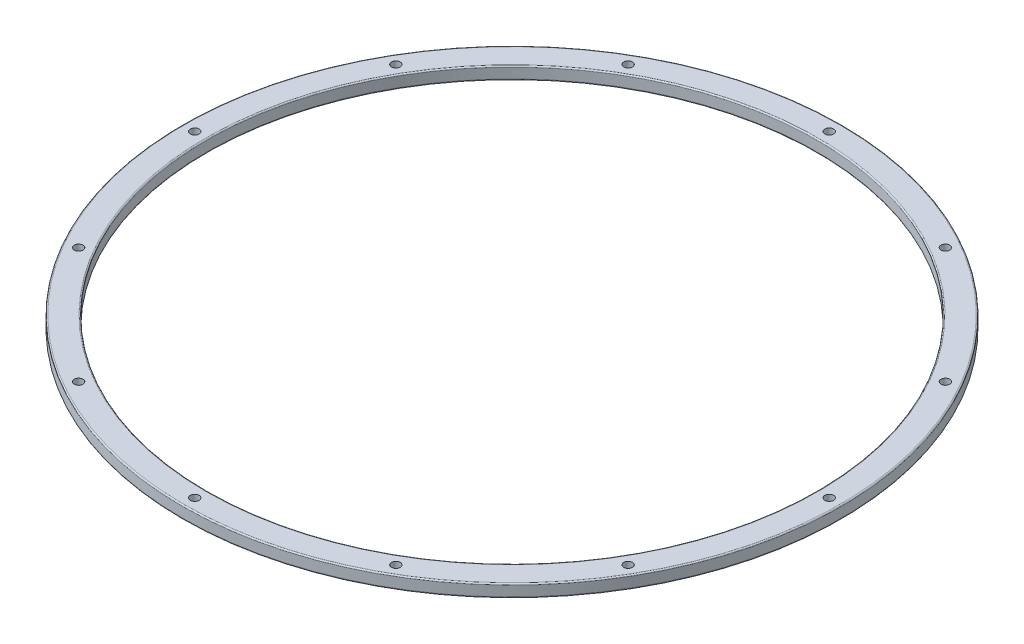
ISO-10303-21;
HEADER;
FILE_DESCRIPTION(('STEP AP214'),'2;1');
FILE_NAME('part.step','',(''),(''),'','','');
FILE_SCHEMA(('AUTOMOTIVE_DESIGN { 1 0 10303 214 1 1 1 1 }'));
ENDSEC;
DATA;
#1=APPLICATION_CONTEXT('core data for automotive mechanical design processes');
#2=APPLICATION_PROTOCOL_DEFINITION('international standard','automotive_design',2000,#1);
#3=PRODUCT_CONTEXT('',#1,'mechanical');
#4=PRODUCT('Part','Part','',(#3));
#5=PRODUCT_RELATED_PRODUCT_CATEGORY('part','',(#4));
#6=PRODUCT_DEFINITION_FORMATION('','',#4);
#7=PRODUCT_DEFINITION_CONTEXT('part definition',#1,'design');
#8=PRODUCT_DEFINITION('design','',#6,#7);
#9=PRODUCT_DEFINITION_SHAPE('','',#8);
#10=(LENGTH_UNIT() NAMED_UNIT(*) SI_UNIT(.MILLI.,.METRE.));
#11=(NAMED_UNIT(*) PLANE_ANGLE_UNIT() SI_UNIT($,.RADIAN.));
#12=(NAMED_UNIT(*) SI_UNIT($,.STERADIAN.) SOLID_ANGLE_UNIT());
#13=UNCERTAINTY_MEASURE_WITH_UNIT(LENGTH_MEASURE(1.E-05),#10,'distance_accuracy_value','');
#14=(GEOMETRIC_REPRESENTATION_CONTEXT(3) GLOBAL_UNCERTAINTY_ASSIGNED_CONTEXT((#13)) GLOBAL_UNIT_ASSIGNED_CONTEXT((#10,
#11,#12)) REPRESENTATION_CONTEXT('',''));
#15=CARTESIAN_POINT('',(0.,0.,0.));
#16=DIRECTION('',(0.,0.,1.));
#17=DIRECTION('',(1.,0.,0.));
#18=AXIS2_PLACEMENT_3D('',#15,#16,#17);
#19=CARTESIAN_POINT('',(-76.5175,3.17499999999999,0.));
#20=DIRECTION('',(0.,1.,0.));
#21=DIRECTION('',(0.,0.,1.));
#22=AXIS2_PLACEMENT_3D('',#19,#20,#21);
#23=PLANE('',#22);
#24=CARTESIAN_POINT('',(-68.6582775056797,3.175,39.6398749999993));
#25=DIRECTION('',(0.,-1.,0.));
#26=DIRECTION('',(0.,0.,-1.));
#27=AXIS2_PLACEMENT_3D('',#24,#25,#26);
#28=CIRCLE('',#27,1.0922);
#29=CARTESIAN_POINT('',(-68.6582775056797,3.175,38.5476749999993));
#30=VERTEX_POINT('',#29);
#31=EDGE_CURVE('E131',#30,#30,#28,.T.);
#32=ORIENTED_EDGE('',*,*,#31,.T.);
#33=EDGE_LOOP('',(#32));
#34=FACE_BOUND('',#33,.T.);
#35=CARTESIAN_POINT('',(-39.6398750000007,3.175,68.658277505679));
#36=DIRECTION('',(0.,-1.,0.));
#37=DIRECTION('',(0.,0.,-1.));
#38=AXIS2_PLACEMENT_3D('',#35,#36,#37);
#39=CIRCLE('',#38,1.0922);
#40=CARTESIAN_POINT('',(-39.6398750000007,3.175,67.5660775056789));
#41=VERTEX_POINT('',#40);
#42=EDGE_CURVE('E125',#41,#41,#39,.T.);
#43=ORIENTED_EDGE('',*,*,#42,.T.);
#44=EDGE_LOOP('',(#43));
#45=FACE_BOUND('',#44,.T.);
#46=CARTESIAN_POINT('',(79.27975,3.175,4.47985690742466E-13));
#47=DIRECTION('',(0.,-1.,0.));
#48=DIRECTION('',(0.,0.,-1.));
#49=AXIS2_PLACEMENT_3D('',#46,#47,#48);
#50=CIRCLE('',#49,1.0922);
#51=CARTESIAN_POINT('',(79.27975,3.175,-1.09219999999955));
#52=VERTEX_POINT('',#51);
#53=EDGE_CURVE('E101',#52,#52,#50,.T.);
#54=ORIENTED_EDGE('',*,*,#53,.T.);
#55=EDGE_LOOP('',(#54));
#56=FACE_BOUND('',#55,.T.);
#57=CARTESIAN_POINT('',(68.6582775056795,3.175,-39.6398749999996));
#58=DIRECTION('',(0.,-1.,0.));
#59=DIRECTION('',(0.,0.,-1.));
#60=AXIS2_PLACEMENT_3D('',#57,#58,#59);
#61=CIRCLE('',#60,1.0922);
#62=CARTESIAN_POINT('',(68.6582775056795,3.175,-40.7320749999997));
#63=VERTEX_POINT('',#62);
#64=EDGE_CURVE('E95',#63,#63,#61,.T.);
#65=ORIENTED_EDGE('',*,*,#64,.T.);
#66=EDGE_LOOP('',(#65));
#67=FACE_BOUND('',#66,.T.);
#68=CARTESIAN_POINT('',(39.6398750000002,3.175,-68.6582775056792));
#69=DIRECTION('',(0.,-1.,0.));
#70=DIRECTION('',(0.,0.,-1.));
#71=AXIS2_PLACEMENT_3D('',#68,#69,#70);
#72=CIRCLE('',#71,1.0922);
#73=CARTESIAN_POINT('',(39.6398750000002,3.175,-69.7504775056792));
#74=VERTEX_POINT('',#73);
#75=EDGE_CURVE('E89',#74,#74,#72,.T.);
#76=ORIENTED_EDGE('',*,*,#75,.T.);
#77=EDGE_LOOP('',(#76));
#78=FACE_BOUND('',#77,.T.);
#79=CARTESIAN_POINT('',(2.23992845371233E-13,3.175,-79.27975));
#80=DIRECTION('',(0.,-1.,0.));
#81=DIRECTION('',(0.,0.,-1.));
#82=AXIS2_PLACEMENT_3D('',#79,#80,#81);
#83=CIRCLE('',#82,1.0922);
#84=CARTESIAN_POINT('',(2.23992845371233E-13,3.175,-80.37195));
#85=VERTEX_POINT('',#84);
#86=EDGE_CURVE('E83',#85,#85,#83,.T.);
#87=ORIENTED_EDGE('',*,*,#86,.T.);
#88=EDGE_LOOP('',(#87));
#89=FACE_BOUND('',#88,.T.);
#90=CARTESIAN_POINT('',(-39.6398749999999,3.175,-68.6582775056794));
#91=DIRECTION('',(0.,-1.,0.));
#92=DIRECTION('',(0.,0.,-1.));
#93=AXIS2_PLACEMENT_3D('',#90,#91,#92);
#94=CIRCLE('',#93,1.0922);
#95=CARTESIAN_POINT('',(-39.6398749999999,3.175,-69.7504775056794));
#96=VERTEX_POINT('',#95);
#97=EDGE_CURVE('E77',#96,#96,#94,.T.);
#98=ORIENTED_EDGE('',*,*,#97,.T.);
#99=EDGE_LOOP('',(#98));
#100=FACE_BOUND('',#99,.T.);
#101=CARTESIAN_POINT('',(-68.6582775056793,3.175,-39.6398750000001));
#102=DIRECTION('',(0.,-1.,0.));
#103=DIRECTION('',(0.,0.,-1.));
#104=AXIS2_PLACEMENT_3D('',#101,#102,#103);
#105=CIRCLE('',#104,1.0922);
#106=CARTESIAN_POINT('',(-68.6582775056793,3.175,-40.7320750000001));
#107=VERTEX_POINT('',#106);
#108=EDGE_CURVE('E71',#107,#107,#105,.T.);
#109=ORIENTED_EDGE('',*,*,#108,.T.);
#110=EDGE_LOOP('',(#109));
#111=FACE_BOUND('',#110,.T.);
#112=CARTESIAN_POINT('',(-79.27975,3.175,0.));
#113=DIRECTION('',(0.,-1.,0.));
#114=DIRECTION('',(0.,0.,-1.));
#115=AXIS2_PLACEMENT_3D('',#112,#113,#114);
#116=CIRCLE('',#115,1.0922);
#117=CARTESIAN_POINT('',(-79.27975,3.175,-1.0922));
#118=VERTEX_POINT('',#117);
#119=EDGE_CURVE('E65',#118,#118,#116,.T.);
#120=ORIENTED_EDGE('',*,*,#119,.T.);
#121=EDGE_LOOP('',(#120));
#122=FACE_BOUND('',#121,.T.);
#123=CARTESIAN_POINT('',(0.,3.17499999999999,0.));
#124=DIRECTION('',(0.,1.,0.));
#125=DIRECTION('',(0.,0.,1.));
#126=AXIS2_PLACEMENT_3D('',#123,#124,#125);
#127=CIRCLE('',#126,82.042);
#128=CARTESIAN_POINT('',(0.,3.17499999999999,82.042));
#129=VERTEX_POINT('',#128);
#130=EDGE_CURVE('E62',#129,#129,#127,.T.);
#131=ORIENTED_EDGE('',*,*,#130,.T.);
#132=EDGE_LOOP('',(#131));
#133=FACE_BOUND('',#132,.T.);
#134=CARTESIAN_POINT('',(0.,3.175,0.));
#135=DIRECTION('',(0.,1.,0.));
#136=DIRECTION('',(0.,0.,1.));
#137=AXIS2_PLACEMENT_3D('',#134,#135,#136);
#138=CIRCLE('',#137,76.5175);
#139=CARTESIAN_POINT('',(0.,3.175,76.5175));
#140=VERTEX_POINT('',#139);
#141=EDGE_CURVE('E59',#140,#140,#138,.T.);
#142=ORIENTED_EDGE('',*,*,#141,.F.);
#143=EDGE_LOOP('',(#142));
#144=FACE_BOUND('',#143,.T.);
#145=CARTESIAN_POINT('',(68.6582775056791,3.175,39.6398750000004));
#146=DIRECTION('',(0.,-1.,0.));
#147=DIRECTION('',(0.,0.,-1.));
#148=AXIS2_PLACEMENT_3D('',#145,#146,#147);
#149=CIRCLE('',#148,1.0922);
#150=CARTESIAN_POINT('',(68.6582775056791,3.175,38.5476750000004));
#151=VERTEX_POINT('',#150);
#152=EDGE_CURVE('E107',#151,#151,#149,.T.);
#153=ORIENTED_EDGE('',*,*,#152,.T.);
#154=EDGE_LOOP('',(#153));
#155=FACE_BOUND('',#154,.T.);
#156=CARTESIAN_POINT('',(39.6398749999995,3.175,68.6582775056796));
#157=DIRECTION('',(0.,-1.,0.));
#158=DIRECTION('',(0.,0.,-1.));
#159=AXIS2_PLACEMENT_3D('',#156,#157,#158);
#160=CIRCLE('',#159,1.0922);
#161=CARTESIAN_POINT('',(39.6398749999995,3.175,67.5660775056796));
#162=VERTEX_POINT('',#161);
#163=EDGE_CURVE('E113',#162,#162,#160,.T.);
#164=ORIENTED_EDGE('',*,*,#163,.T.);
#165=EDGE_LOOP('',(#164));
#166=FACE_BOUND('',#165,.T.);
#167=CARTESIAN_POINT('',(-6.89582176881005E-13,3.175,79.27975));
#168=DIRECTION('',(0.,-1.,0.));
#169=DIRECTION('',(0.,0.,-1.));
#170=AXIS2_PLACEMENT_3D('',#167,#168,#169);
#171=CIRCLE('',#170,1.0922);
#172=CARTESIAN_POINT('',(-6.89582176881005E-13,3.175,78.18755));
#173=VERTEX_POINT('',#172);
#174=EDGE_CURVE('E119',#173,#173,#171,.T.);
#175=ORIENTED_EDGE('',*,*,#174,.T.);
#176=EDGE_LOOP('',(#175));
#177=FACE_BOUND('',#176,.T.);
#178=ADVANCED_FACE('F33',(#34,#45,#56,#67,#78,#89,#100,#111,#122,#133,#144,#155,#166,#177),#23,.T.);
#179=CARTESIAN_POINT('',(0.,2.85749999999999,0.));
#180=DIRECTION('',(0.,1.,0.));
#181=DIRECTION('',(0.,0.,1.));
#182=AXIS2_PLACEMENT_3D('',#179,#180,#181);
#183=TOROIDAL_SURFACE('',#182,82.042,0.317499999999999);
#184=CARTESIAN_POINT('',(0.,2.85749999999999,0.));
#185=DIRECTION('',(0.,1.,0.));
#186=DIRECTION('',(0.,0.,1.));
#187=AXIS2_PLACEMENT_3D('',#184,#185,#186);
#188=CIRCLE('',#187,82.3595);
#189=CARTESIAN_POINT('',(0.,2.85749999999999,82.3595));
#190=VERTEX_POINT('',#189);
#191=EDGE_CURVE('E10',#190,#190,#188,.T.);
#192=ORIENTED_EDGE('',*,*,#191,.T.);
#193=EDGE_LOOP('',(#192));
#194=FACE_BOUND('',#193,.T.);
#195=ORIENTED_EDGE('',*,*,#130,.F.);
#196=EDGE_LOOP('',(#195));
#197=FACE_BOUND('',#196,.T.);
#198=ADVANCED_FACE('F35',(#194,#197),#183,.T.);
#199=CARTESIAN_POINT('',(0.,55.,0.));
#200=DIRECTION('',(0.,1.,0.));
#201=DIRECTION('',(0.,0.,1.));
#202=AXIS2_PLACEMENT_3D('',#199,#200,#201);
#203=CYLINDRICAL_SURFACE('',#202,82.3595);
#204=CARTESIAN_POINT('',(0.,0.317499999999991,0.));
#205=DIRECTION('',(0.,1.,0.));
#206=DIRECTION('',(0.,0.,1.));
#207=AXIS2_PLACEMENT_3D('',#204,#205,#206);
#208=CIRCLE('',#207,82.3595);
#209=CARTESIAN_POINT('',(0.,0.317499999999991,82.3595));
#210=VERTEX_POINT('',#209);
#211=EDGE_CURVE('E40',#210,#210,#208,.T.);
#212=ORIENTED_EDGE('',*,*,#211,.T.);
#213=EDGE_LOOP('',(#212));
#214=FACE_BOUND('',#213,.T.);
#215=ORIENTED_EDGE('',*,*,#191,.F.);
#216=EDGE_LOOP('',(#215));
#217=FACE_BOUND('',#216,.T.);
#218=ADVANCED_FACE('F174',(#214,#217),#203,.T.);
#219=CARTESIAN_POINT('',(0.,0.317499999999993,0.));
#220=DIRECTION('',(0.,1.,0.));
#221=DIRECTION('',(0.,0.,1.));
#222=AXIS2_PLACEMENT_3D('',#219,#220,#221);
#223=TOROIDAL_SURFACE('',#222,82.042,0.317499999999999);
#224=CARTESIAN_POINT('',(0.,0.,0.));
#225=DIRECTION('',(0.,1.,0.));
#226=DIRECTION('',(0.,0.,1.));
#227=AXIS2_PLACEMENT_3D('',#224,#225,#226);
#228=CIRCLE('',#227,82.042);
#229=CARTESIAN_POINT('',(0.,0.,82.042));
#230=VERTEX_POINT('',#229);
#231=EDGE_CURVE('E44',#230,#230,#228,.T.);
#232=ORIENTED_EDGE('',*,*,#231,.T.);
#233=EDGE_LOOP('',(#232));
#234=FACE_BOUND('',#233,.T.);
#235=ORIENTED_EDGE('',*,*,#211,.F.);
#236=EDGE_LOOP('',(#235));
#237=FACE_BOUND('',#236,.T.);
#238=ADVANCED_FACE('F144',(#234,#237),#223,.T.);
#239=CARTESIAN_POINT('',(-76.5175,0.,0.));
#240=DIRECTION('',(0.,-1.,0.));
#241=DIRECTION('',(0.,0.,-1.));
#242=AXIS2_PLACEMENT_3D('',#239,#240,#241);
#243=PLANE('',#242);
#244=CARTESIAN_POINT('',(-68.6582775056797,0.,39.6398749999993));
#245=DIRECTION('',(0.,-1.,0.));
#246=DIRECTION('',(0.,0.,-1.));
#247=AXIS2_PLACEMENT_3D('',#244,#245,#246);
#248=CIRCLE('',#247,1.0922);
#249=CARTESIAN_POINT('',(-68.6582775056797,0.,38.5476749999993));
#250=VERTEX_POINT('',#249);
#251=EDGE_CURVE('E134',#250,#250,#248,.T.);
#252=ORIENTED_EDGE('',*,*,#251,.F.);
#253=EDGE_LOOP('',(#252));
#254=FACE_BOUND('',#253,.T.);
#255=CARTESIAN_POINT('',(-39.6398750000007,0.,68.658277505679));
#256=DIRECTION('',(0.,-1.,0.));
#257=DIRECTION('',(0.,0.,-1.));
#258=AXIS2_PLACEMENT_3D('',#255,#256,#257);
#259=CIRCLE('',#258,1.0922);
#260=CARTESIAN_POINT('',(-39.6398750000007,0.,67.5660775056789));
#261=VERTEX_POINT('',#260);
#262=EDGE_CURVE('E128',#261,#261,#259,.T.);
#263=ORIENTED_EDGE('',*,*,#262,.F.);
#264=EDGE_LOOP('',(#263));
#265=FACE_BOUND('',#264,.T.);
#266=CARTESIAN_POINT('',(-6.89582176881005E-13,0.,79.27975));
#267=DIRECTION('',(0.,-1.,0.));
#268=DIRECTION('',(0.,0.,-1.));
#269=AXIS2_PLACEMENT_3D('',#266,#267,#268);
#270=CIRCLE('',#269,1.0922);
#271=CARTESIAN_POINT('',(-6.89582176881005E-13,0.,78.18755));
#272=VERTEX_POINT('',#271);
#273=EDGE_CURVE('E122',#272,#272,#270,.T.);
#274=ORIENTED_EDGE('',*,*,#273,.F.);
#275=EDGE_LOOP('',(#274));
#276=FACE_BOUND('',#275,.T.);
#277=CARTESIAN_POINT('',(39.6398749999995,0.,68.6582775056796));
#278=DIRECTION('',(0.,-1.,0.));
#279=DIRECTION('',(0.,0.,-1.));
#280=AXIS2_PLACEMENT_3D('',#277,#278,#279);
#281=CIRCLE('',#280,1.0922);
#282=CARTESIAN_POINT('',(39.6398749999995,0.,67.5660775056796));
#283=VERTEX_POINT('',#282);
#284=EDGE_CURVE('E116',#283,#283,#281,.T.);
#285=ORIENTED_EDGE('',*,*,#284,.F.);
#286=EDGE_LOOP('',(#285));
#287=FACE_BOUND('',#286,.T.);
#288=CARTESIAN_POINT('',(68.6582775056791,0.,39.6398750000004));
#289=DIRECTION('',(0.,-1.,0.));
#290=DIRECTION('',(0.,0.,-1.));
#291=AXIS2_PLACEMENT_3D('',#288,#289,#290);
#292=CIRCLE('',#291,1.0922);
#293=CARTESIAN_POINT('',(68.6582775056791,0.,38.5476750000004));
#294=VERTEX_POINT('',#293);
#295=EDGE_CURVE('E110',#294,#294,#292,.T.);
#296=ORIENTED_EDGE('',*,*,#295,.F.);
#297=EDGE_LOOP('',(#296));
#298=FACE_BOUND('',#297,.T.);
#299=CARTESIAN_POINT('',(79.27975,0.,4.47985690742466E-13));
#300=DIRECTION('',(0.,-1.,0.));
#301=DIRECTION('',(0.,0.,-1.));
#302=AXIS2_PLACEMENT_3D('',#299,#300,#301);
#303=CIRCLE('',#302,1.0922);
#304=CARTESIAN_POINT('',(79.27975,0.,-1.09219999999955));
#305=VERTEX_POINT('',#304);
#306=EDGE_CURVE('E104',#305,#305,#303,.T.);
#307=ORIENTED_EDGE('',*,*,#306,.F.);
#308=EDGE_LOOP('',(#307));
#309=FACE_BOUND('',#308,.T.);
#310=CARTESIAN_POINT('',(68.6582775056795,0.,-39.6398749999996));
#311=DIRECTION('',(0.,-1.,0.));
#312=DIRECTION('',(0.,0.,-1.));
#313=AXIS2_PLACEMENT_3D('',#310,#311,#312);
#314=CIRCLE('',#313,1.0922);
#315=CARTESIAN_POINT('',(68.6582775056795,0.,-40.7320749999997));
#316=VERTEX_POINT('',#315);
#317=EDGE_CURVE('E98',#316,#316,#314,.T.);
#318=ORIENTED_EDGE('',*,*,#317,.F.);
#319=EDGE_LOOP('',(#318));
#320=FACE_BOUND('',#319,.T.);
#321=CARTESIAN_POINT('',(39.6398750000002,0.,-68.6582775056792));
#322=DIRECTION('',(0.,-1.,0.));
#323=DIRECTION('',(0.,0.,-1.));
#324=AXIS2_PLACEMENT_3D('',#321,#322,#323);
#325=CIRCLE('',#324,1.0922);
#326=CARTESIAN_POINT('',(39.6398750000002,0.,-69.7504775056792));
#327=VERTEX_POINT('',#326);
#328=EDGE_CURVE('E92',#327,#327,#325,.T.);
#329=ORIENTED_EDGE('',*,*,#328,.F.);
#330=EDGE_LOOP('',(#329));
#331=FACE_BOUND('',#330,.T.);
#332=CARTESIAN_POINT('',(2.23992845371233E-13,0.,-79.27975));
#333=DIRECTION('',(0.,-1.,0.));
#334=DIRECTION('',(0.,0.,-1.));
#335=AXIS2_PLACEMENT_3D('',#332,#333,#334);
#336=CIRCLE('',#335,1.0922);
#337=CARTESIAN_POINT('',(2.23992845371233E-13,0.,-80.37195));
#338=VERTEX_POINT('',#337);
#339=EDGE_CURVE('E86',#338,#338,#336,.T.);
#340=ORIENTED_EDGE('',*,*,#339,.F.);
#341=EDGE_LOOP('',(#340));
#342=FACE_BOUND('',#341,.T.);
#343=CARTESIAN_POINT('',(-39.6398749999999,0.,-68.6582775056794));
#344=DIRECTION('',(0.,-1.,0.));
#345=DIRECTION('',(0.,0.,-1.));
#346=AXIS2_PLACEMENT_3D('',#343,#344,#345);
#347=CIRCLE('',#346,1.0922);
#348=CARTESIAN_POINT('',(-39.6398749999999,0.,-69.7504775056794));
#349=VERTEX_POINT('',#348);
#350=EDGE_CURVE('E80',#349,#349,#347,.T.);
#351=ORIENTED_EDGE('',*,*,#350,.F.);
#352=EDGE_LOOP('',(#351));
#353=FACE_BOUND('',#352,.T.);
#354=CARTESIAN_POINT('',(-68.6582775056793,0.,-39.6398750000001));
#355=DIRECTION('',(0.,-1.,0.));
#356=DIRECTION('',(0.,0.,-1.));
#357=AXIS2_PLACEMENT_3D('',#354,#355,#356);
#358=CIRCLE('',#357,1.0922);
#359=CARTESIAN_POINT('',(-68.6582775056793,0.,-40.7320750000001));
#360=VERTEX_POINT('',#359);
#361=EDGE_CURVE('E74',#360,#360,#358,.T.);
#362=ORIENTED_EDGE('',*,*,#361,.F.);
#363=EDGE_LOOP('',(#362));
#364=FACE_BOUND('',#363,.T.);
#365=CARTESIAN_POINT('',(-79.27975,0.,0.));
#366=DIRECTION('',(0.,-1.,0.));
#367=DIRECTION('',(0.,0.,-1.));
#368=AXIS2_PLACEMENT_3D('',#365,#366,#367);
#369=CIRCLE('',#368,1.0922);
#370=CARTESIAN_POINT('',(-79.27975,0.,-1.0922));
#371=VERTEX_POINT('',#370);
#372=EDGE_CURVE('E68',#371,#371,#369,.T.);
#373=ORIENTED_EDGE('',*,*,#372,.F.);
#374=EDGE_LOOP('',(#373));
#375=FACE_BOUND('',#374,.T.);
#376=CARTESIAN_POINT('',(0.,0.,0.));
#377=DIRECTION('',(0.,1.,0.));
#378=DIRECTION('',(0.,0.,1.));
#379=AXIS2_PLACEMENT_3D('',#376,#377,#378);
#380=CIRCLE('',#379,76.5175);
#381=CARTESIAN_POINT('',(0.,0.,76.5175));
#382=VERTEX_POINT('',#381);
#383=EDGE_CURVE('E48',#382,#382,#380,.T.);
#384=ORIENTED_EDGE('',*,*,#383,.T.);
#385=EDGE_LOOP('',(#384));
#386=FACE_BOUND('',#385,.T.);
#387=ORIENTED_EDGE('',*,*,#231,.F.);
#388=EDGE_LOOP('',(#387));
#389=FACE_BOUND('',#388,.T.);
#390=ADVANCED_FACE('F140',(#254,#265,#276,#287,#298,#309,#320,#331,#342,#353,#364,#375,#386,
#389),#243,.T.);
#391=CARTESIAN_POINT('',(0.,0.317499999999994,0.));
#392=DIRECTION('',(0.,1.,0.));
#393=DIRECTION('',(0.,0.,1.));
#394=AXIS2_PLACEMENT_3D('',#391,#392,#393);
#395=TOROIDAL_SURFACE('',#394,76.5175,0.317499999999999);
#396=CARTESIAN_POINT('',(0.,0.317499999999998,0.));
#397=DIRECTION('',(0.,1.,0.));
#398=DIRECTION('',(0.,0.,1.));
#399=AXIS2_PLACEMENT_3D('',#396,#397,#398);
#400=CIRCLE('',#399,76.2);
#401=CARTESIAN_POINT('',(0.,0.317499999999998,76.2));
#402=VERTEX_POINT('',#401);
#403=EDGE_CURVE('E53',#402,#402,#400,.T.);
#404=ORIENTED_EDGE('',*,*,#403,.T.);
#405=EDGE_LOOP('',(#404));
#406=FACE_BOUND('',#405,.T.);
#407=ORIENTED_EDGE('',*,*,#383,.F.);
#408=EDGE_LOOP('',(#407));
#409=FACE_BOUND('',#408,.T.);
#410=ADVANCED_FACE('F143',(#406,#409),#395,.T.);
#411=CARTESIAN_POINT('',(0.,55.,0.));
#412=DIRECTION('',(0.,1.,0.));
#413=DIRECTION('',(0.,0.,1.));
#414=AXIS2_PLACEMENT_3D('',#411,#412,#413);
#415=CYLINDRICAL_SURFACE('',#414,76.2);
#416=CARTESIAN_POINT('',(0.,2.85749999999999,0.));
#417=DIRECTION('',(0.,1.,0.));
#418=DIRECTION('',(0.,0.,1.));
#419=AXIS2_PLACEMENT_3D('',#416,#417,#418);
#420=CIRCLE('',#419,76.2);
#421=CARTESIAN_POINT('',(0.,2.85749999999999,76.2));
#422=VERTEX_POINT('',#421);
#423=EDGE_CURVE('E56',#422,#422,#420,.T.);
#424=ORIENTED_EDGE('',*,*,#423,.T.);
#425=EDGE_LOOP('',(#424));
#426=FACE_BOUND('',#425,.T.);
#427=ORIENTED_EDGE('',*,*,#403,.F.);
#428=EDGE_LOOP('',(#427));
#429=FACE_BOUND('',#428,.T.);
#430=ADVANCED_FACE('F193',(#426,#429),#415,.F.);
#431=CARTESIAN_POINT('',(0.,2.85749999999999,0.));
#432=DIRECTION('',(0.,1.,0.));
#433=DIRECTION('',(0.,0.,1.));
#434=AXIS2_PLACEMENT_3D('',#431,#432,#433);
#435=TOROIDAL_SURFACE('',#434,76.5175,0.317499999999999);
#436=ORIENTED_EDGE('',*,*,#141,.T.);
#437=EDGE_LOOP('',(#436));
#438=FACE_BOUND('',#437,.T.);
#439=ORIENTED_EDGE('',*,*,#423,.F.);
#440=EDGE_LOOP('',(#439));
#441=FACE_BOUND('',#440,.T.);
#442=ADVANCED_FACE('F190',(#438,#441),#435,.T.);
#443=CARTESIAN_POINT('',(-79.27975,0.,0.));
#444=DIRECTION('',(0.,-1.,0.));
#445=DIRECTION('',(0.,0.,-1.));
#446=AXIS2_PLACEMENT_3D('',#443,#444,#445);
#447=CYLINDRICAL_SURFACE('',#446,1.0922);
#448=ORIENTED_EDGE('',*,*,#119,.F.);
#449=EDGE_LOOP('',(#448));
#450=FACE_BOUND('',#449,.T.);
#451=ORIENTED_EDGE('',*,*,#372,.T.);
#452=EDGE_LOOP('',(#451));
#453=FACE_BOUND('',#452,.T.);
#454=ADVANCED_FACE('F188',(#450,#453),#447,.F.);
#455=CARTESIAN_POINT('',(-68.6582775056793,0.,-39.6398750000001));
#456=DIRECTION('',(0.,-1.,0.));
#457=DIRECTION('',(0.,0.,-1.));
#458=AXIS2_PLACEMENT_3D('',#455,#456,#457);
#459=CYLINDRICAL_SURFACE('',#458,1.0922);
#460=ORIENTED_EDGE('',*,*,#108,.F.);
#461=EDGE_LOOP('',(#460));
#462=FACE_BOUND('',#461,.T.);
#463=ORIENTED_EDGE('',*,*,#361,.T.);
#464=EDGE_LOOP('',(#463));
#465=FACE_BOUND('',#464,.T.);
#466=ADVANCED_FACE('F222',(#462,#465),#459,.F.);
#467=CARTESIAN_POINT('',(-39.6398749999999,0.,-68.6582775056794));
#468=DIRECTION('',(0.,-1.,0.));
#469=DIRECTION('',(0.,0.,-1.));
#470=AXIS2_PLACEMENT_3D('',#467,#468,#469);
#471=CYLINDRICAL_SURFACE('',#470,1.0922);
#472=ORIENTED_EDGE('',*,*,#97,.F.);
#473=EDGE_LOOP('',(#472));
#474=FACE_BOUND('',#473,.T.);
#475=ORIENTED_EDGE('',*,*,#350,.T.);
#476=EDGE_LOOP('',(#475));
#477=FACE_BOUND('',#476,.T.);
#478=ADVANCED_FACE('F228',(#474,#477),#471,.F.);
#479=CARTESIAN_POINT('',(2.23992845371233E-13,0.,-79.27975));
#480=DIRECTION('',(0.,-1.,0.));
#481=DIRECTION('',(0.,0.,-1.));
#482=AXIS2_PLACEMENT_3D('',#479,#480,#481);
#483=CYLINDRICAL_SURFACE('',#482,1.0922);
#484=ORIENTED_EDGE('',*,*,#86,.F.);
#485=EDGE_LOOP('',(#484));
#486=FACE_BOUND('',#485,.T.);
#487=ORIENTED_EDGE('',*,*,#339,.T.);
#488=EDGE_LOOP('',(#487));
#489=FACE_BOUND('',#488,.T.);
#490=ADVANCED_FACE('F235',(#486,#489),#483,.F.);
#491=CARTESIAN_POINT('',(39.6398750000002,0.,-68.6582775056792));
#492=DIRECTION('',(0.,-1.,0.));
#493=DIRECTION('',(0.,0.,-1.));
#494=AXIS2_PLACEMENT_3D('',#491,#492,#493);
#495=CYLINDRICAL_SURFACE('',#494,1.0922);
#496=ORIENTED_EDGE('',*,*,#75,.F.);
#497=EDGE_LOOP('',(#496));
#498=FACE_BOUND('',#497,.T.);
#499=ORIENTED_EDGE('',*,*,#328,.T.);
#500=EDGE_LOOP('',(#499));
#501=FACE_BOUND('',#500,.T.);
#502=ADVANCED_FACE('F243',(#498,#501),#495,.F.);
#503=CARTESIAN_POINT('',(68.6582775056795,0.,-39.6398749999996));
#504=DIRECTION('',(0.,-1.,0.));
#505=DIRECTION('',(0.,0.,-1.));
#506=AXIS2_PLACEMENT_3D('',#503,#504,#505);
#507=CYLINDRICAL_SURFACE('',#506,1.0922);
#508=ORIENTED_EDGE('',*,*,#64,.F.);
#509=EDGE_LOOP('',(#508));
#510=FACE_BOUND('',#509,.T.);
#511=ORIENTED_EDGE('',*,*,#317,.T.);
#512=EDGE_LOOP('',(#511));
#513=FACE_BOUND('',#512,.T.);
#514=ADVANCED_FACE('F251',(#510,#513),#507,.F.);
#515=CARTESIAN_POINT('',(79.27975,0.,4.47985690742466E-13));
#516=DIRECTION('',(0.,-1.,0.));
#517=DIRECTION('',(0.,0.,-1.));
#518=AXIS2_PLACEMENT_3D('',#515,#516,#517);
#519=CYLINDRICAL_SURFACE('',#518,1.0922);
#520=ORIENTED_EDGE('',*,*,#53,.F.);
#521=EDGE_LOOP('',(#520));
#522=FACE_BOUND('',#521,.T.);
#523=ORIENTED_EDGE('',*,*,#306,.T.);
#524=EDGE_LOOP('',(#523));
#525=FACE_BOUND('',#524,.T.);
#526=ADVANCED_FACE('F259',(#522,#525),#519,.F.);
#527=CARTESIAN_POINT('',(68.6582775056791,0.,39.6398750000004));
#528=DIRECTION('',(0.,-1.,0.));
#529=DIRECTION('',(0.,0.,-1.));
#530=AXIS2_PLACEMENT_3D('',#527,#528,#529);
#531=CYLINDRICAL_SURFACE('',#530,1.0922);
#532=ORIENTED_EDGE('',*,*,#152,.F.);
#533=EDGE_LOOP('',(#532));
#534=FACE_BOUND('',#533,.T.);
#535=ORIENTED_EDGE('',*,*,#295,.T.);
#536=EDGE_LOOP('',(#535));
#537=FACE_BOUND('',#536,.T.);
#538=ADVANCED_FACE('F267',(#534,#537),#531,.F.);
#539=CARTESIAN_POINT('',(39.6398749999995,0.,68.6582775056796));
#540=DIRECTION('',(0.,-1.,0.));
#541=DIRECTION('',(0.,0.,-1.));
#542=AXIS2_PLACEMENT_3D('',#539,#540,#541);
#543=CYLINDRICAL_SURFACE('',#542,1.0922);
#544=ORIENTED_EDGE('',*,*,#163,.F.);
#545=EDGE_LOOP('',(#544));
#546=FACE_BOUND('',#545,.T.);
#547=ORIENTED_EDGE('',*,*,#284,.T.);
#548=EDGE_LOOP('',(#547));
#549=FACE_BOUND('',#548,.T.);
#550=ADVANCED_FACE('F275',(#546,#549),#543,.F.);
#551=CARTESIAN_POINT('',(-6.89582176881005E-13,0.,79.27975));
#552=DIRECTION('',(0.,-1.,0.));
#553=DIRECTION('',(0.,0.,-1.));
#554=AXIS2_PLACEMENT_3D('',#551,#552,#553);
#555=CYLINDRICAL_SURFACE('',#554,1.0922);
#556=ORIENTED_EDGE('',*,*,#174,.F.);
#557=EDGE_LOOP('',(#556));
#558=FACE_BOUND('',#557,.T.);
#559=ORIENTED_EDGE('',*,*,#273,.T.);
#560=EDGE_LOOP('',(#559));
#561=FACE_BOUND('',#560,.T.);
#562=ADVANCED_FACE('F283',(#558,#561),#555,.F.);
#563=CARTESIAN_POINT('',(-39.6398750000007,0.,68.658277505679));
#564=DIRECTION('',(0.,-1.,0.));
#565=DIRECTION('',(0.,0.,-1.));
#566=AXIS2_PLACEMENT_3D('',#563,#564,#565);
#567=CYLINDRICAL_SURFACE('',#566,1.0922);
#568=ORIENTED_EDGE('',*,*,#42,.F.);
#569=EDGE_LOOP('',(#568));
#570=FACE_BOUND('',#569,.T.);
#571=ORIENTED_EDGE('',*,*,#262,.T.);
#572=EDGE_LOOP('',(#571));
#573=FACE_BOUND('',#572,.T.);
#574=ADVANCED_FACE('F291',(#570,#573),#567,.F.);
#575=CARTESIAN_POINT('',(-68.6582775056797,0.,39.6398749999993));
#576=DIRECTION('',(0.,-1.,0.));
#577=DIRECTION('',(0.,0.,-1.));
#578=AXIS2_PLACEMENT_3D('',#575,#576,#577);
#579=CYLINDRICAL_SURFACE('',#578,1.0922);
#580=ORIENTED_EDGE('',*,*,#31,.F.);
#581=EDGE_LOOP('',(#580));
#582=FACE_BOUND('',#581,.T.);
#583=ORIENTED_EDGE('',*,*,#251,.T.);
#584=EDGE_LOOP('',(#583));
#585=FACE_BOUND('',#584,.T.);
#586=ADVANCED_FACE('F138',(#582,#585),#579,.F.);
#587=CLOSED_SHELL('',(#178,#198,#218,#238,#390,#410,#430,#442,#454,#466,#478,#490,#502,#514,
#526,#538,#550,#562,#574,#586));
#588=MANIFOLD_SOLID_BREP('B2',#587);
#589=ADVANCED_BREP_SHAPE_REPRESENTATION('',(#18,#588),#14);
#590=SHAPE_DEFINITION_REPRESENTATION(#9,#589);
ENDSEC;
END-ISO-10303-21;
